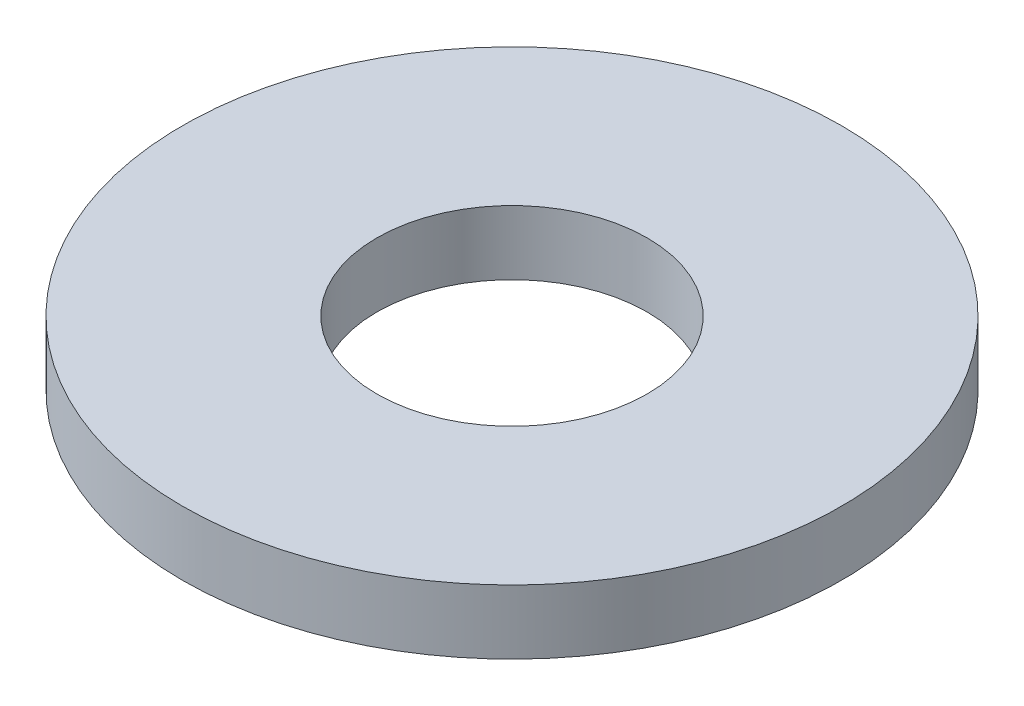
ISO-10303-21;
HEADER;
FILE_DESCRIPTION(('STEP AP214'),'2;1');
FILE_NAME('part.step','',(''),(''),'','','');
FILE_SCHEMA(('AUTOMOTIVE_DESIGN { 1 0 10303 214 1 1 1 1 }'));
ENDSEC;
DATA;
#1=APPLICATION_CONTEXT('core data for automotive mechanical design processes');
#2=APPLICATION_PROTOCOL_DEFINITION('international standard','automotive_design',2000,#1);
#3=PRODUCT_CONTEXT('',#1,'mechanical');
#4=PRODUCT('Part','Part','',(#3));
#5=PRODUCT_RELATED_PRODUCT_CATEGORY('part','',(#4));
#6=PRODUCT_DEFINITION_FORMATION('','',#4);
#7=PRODUCT_DEFINITION_CONTEXT('part definition',#1,'design');
#8=PRODUCT_DEFINITION('design','',#6,#7);
#9=PRODUCT_DEFINITION_SHAPE('','',#8);
#10=(LENGTH_UNIT() NAMED_UNIT(*) SI_UNIT(.MILLI.,.METRE.));
#11=(NAMED_UNIT(*) PLANE_ANGLE_UNIT() SI_UNIT($,.RADIAN.));
#12=(NAMED_UNIT(*) SI_UNIT($,.STERADIAN.) SOLID_ANGLE_UNIT());
#13=UNCERTAINTY_MEASURE_WITH_UNIT(LENGTH_MEASURE(1.E-05),#10,'distance_accuracy_value','');
#14=(GEOMETRIC_REPRESENTATION_CONTEXT(3) GLOBAL_UNCERTAINTY_ASSIGNED_CONTEXT((#13)) GLOBAL_UNIT_ASSIGNED_CONTEXT((#10,
#11,#12)) REPRESENTATION_CONTEXT('',''));
#15=CARTESIAN_POINT('',(0.,0.,0.));
#16=DIRECTION('',(0.,0.,1.));
#17=DIRECTION('',(1.,0.,0.));
#18=AXIS2_PLACEMENT_3D('',#15,#16,#17);
#19=CARTESIAN_POINT('',(0.,19.,0.));
#20=DIRECTION('',(0.,-1.,0.));
#21=DIRECTION('',(0.,0.,-1.));
#22=AXIS2_PLACEMENT_3D('',#19,#20,#21);
#23=CYLINDRICAL_SURFACE('',#22,97.5);
#24=CARTESIAN_POINT('',(0.,19.,0.));
#25=DIRECTION('',(0.,1.,0.));
#26=DIRECTION('',(0.,0.,1.));
#27=AXIS2_PLACEMENT_3D('',#24,#25,#26);
#28=CIRCLE('',#27,97.5);
#29=CARTESIAN_POINT('',(0.,19.,97.5));
#30=VERTEX_POINT('',#29);
#31=EDGE_CURVE('E10',#30,#30,#28,.T.);
#32=ORIENTED_EDGE('',*,*,#31,.F.);
#33=EDGE_LOOP('',(#32));
#34=FACE_BOUND('',#33,.T.);
#35=CARTESIAN_POINT('',(0.,0.,0.));
#36=DIRECTION('',(0.,1.,0.));
#37=DIRECTION('',(0.,0.,1.));
#38=AXIS2_PLACEMENT_3D('',#35,#36,#37);
#39=CIRCLE('',#38,97.5);
#40=CARTESIAN_POINT('',(0.,0.,97.5));
#41=VERTEX_POINT('',#40);
#42=EDGE_CURVE('E37',#41,#41,#39,.T.);
#43=ORIENTED_EDGE('',*,*,#42,.T.);
#44=EDGE_LOOP('',(#43));
#45=FACE_BOUND('',#44,.T.);
#46=ADVANCED_FACE('F40',(#34,#45),#23,.T.);
#47=CARTESIAN_POINT('',(0.,19.,0.));
#48=DIRECTION('',(0.,1.,0.));
#49=DIRECTION('',(0.,0.,1.));
#50=AXIS2_PLACEMENT_3D('',#47,#48,#49);
#51=PLANE('',#50);
#52=CARTESIAN_POINT('',(0.,19.,0.));
#53=DIRECTION('',(0.,1.,0.));
#54=DIRECTION('',(0.,0.,1.));
#55=AXIS2_PLACEMENT_3D('',#52,#53,#54);
#56=CIRCLE('',#55,40.);
#57=CARTESIAN_POINT('',(0.,19.,40.));
#58=VERTEX_POINT('',#57);
#59=EDGE_CURVE('E50',#58,#58,#56,.T.);
#60=ORIENTED_EDGE('',*,*,#59,.F.);
#61=EDGE_LOOP('',(#60));
#62=FACE_BOUND('',#61,.T.);
#63=ORIENTED_EDGE('',*,*,#31,.T.);
#64=EDGE_LOOP('',(#63));
#65=FACE_BOUND('',#64,.T.);
#66=ADVANCED_FACE('F59',(#62,#65),#51,.T.);
#67=CARTESIAN_POINT('',(0.,0.,0.));
#68=DIRECTION('',(0.,1.,0.));
#69=DIRECTION('',(0.,0.,1.));
#70=AXIS2_PLACEMENT_3D('',#67,#68,#69);
#71=PLANE('',#70);
#72=CARTESIAN_POINT('',(0.,0.,0.));
#73=DIRECTION('',(0.,1.,0.));
#74=DIRECTION('',(0.,0.,1.));
#75=AXIS2_PLACEMENT_3D('',#72,#73,#74);
#76=CIRCLE('',#75,40.);
#77=CARTESIAN_POINT('',(0.,0.,40.));
#78=VERTEX_POINT('',#77);
#79=EDGE_CURVE('E47',#78,#78,#76,.T.);
#80=ORIENTED_EDGE('',*,*,#79,.T.);
#81=EDGE_LOOP('',(#80));
#82=FACE_BOUND('',#81,.T.);
#83=ORIENTED_EDGE('',*,*,#42,.F.);
#84=EDGE_LOOP('',(#83));
#85=FACE_BOUND('',#84,.T.);
#86=ADVANCED_FACE('F58',(#82,#85),#71,.F.);
#87=CARTESIAN_POINT('',(0.,19.,0.));
#88=DIRECTION('',(0.,-1.,0.));
#89=DIRECTION('',(0.,0.,-1.));
#90=AXIS2_PLACEMENT_3D('',#87,#88,#89);
#91=CYLINDRICAL_SURFACE('',#90,40.);
#92=ORIENTED_EDGE('',*,*,#59,.T.);
#93=EDGE_LOOP('',(#92));
#94=FACE_BOUND('',#93,.T.);
#95=ORIENTED_EDGE('',*,*,#79,.F.);
#96=EDGE_LOOP('',(#95));
#97=FACE_BOUND('',#96,.T.);
#98=ADVANCED_FACE('F54',(#94,#97),#91,.F.);
#99=CLOSED_SHELL('',(#46,#66,#86,#98));
#100=MANIFOLD_SOLID_BREP('B2',#99);
#101=ADVANCED_BREP_SHAPE_REPRESENTATION('',(#18,#100),#14);
#102=SHAPE_DEFINITION_REPRESENTATION(#9,#101);
ENDSEC;
END-ISO-10303-21;
